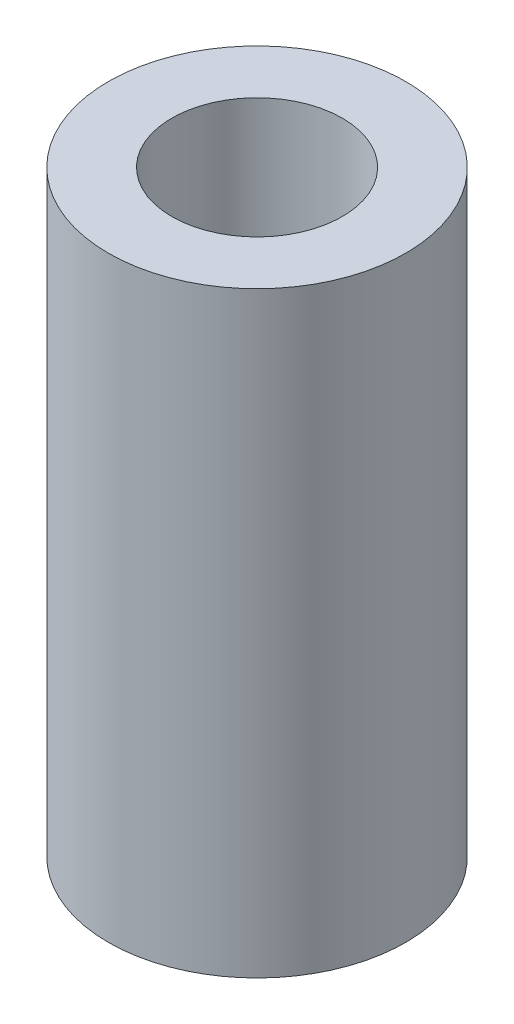
ISO-10303-21;
HEADER;
FILE_DESCRIPTION(('STEP AP214'),'2;1');
FILE_NAME('part.step','',(''),(''),'','','');
FILE_SCHEMA(('AUTOMOTIVE_DESIGN { 1 0 10303 214 1 1 1 1 }'));
ENDSEC;
DATA;
#1=APPLICATION_CONTEXT('core data for automotive mechanical design processes');
#2=APPLICATION_PROTOCOL_DEFINITION('international standard','automotive_design',2000,#1);
#3=PRODUCT_CONTEXT('',#1,'mechanical');
#4=PRODUCT('Part','Part','',(#3));
#5=PRODUCT_RELATED_PRODUCT_CATEGORY('part','',(#4));
#6=PRODUCT_DEFINITION_FORMATION('','',#4);
#7=PRODUCT_DEFINITION_CONTEXT('part definition',#1,'design');
#8=PRODUCT_DEFINITION('design','',#6,#7);
#9=PRODUCT_DEFINITION_SHAPE('','',#8);
#10=(LENGTH_UNIT() NAMED_UNIT(*) SI_UNIT(.MILLI.,.METRE.));
#11=(NAMED_UNIT(*) PLANE_ANGLE_UNIT() SI_UNIT($,.RADIAN.));
#12=(NAMED_UNIT(*) SI_UNIT($,.STERADIAN.) SOLID_ANGLE_UNIT());
#13=UNCERTAINTY_MEASURE_WITH_UNIT(LENGTH_MEASURE(1.E-05),#10,'distance_accuracy_value','');
#14=(GEOMETRIC_REPRESENTATION_CONTEXT(3) GLOBAL_UNCERTAINTY_ASSIGNED_CONTEXT((#13)) GLOBAL_UNIT_ASSIGNED_CONTEXT((#10,
#11,#12)) REPRESENTATION_CONTEXT('',''));
#15=CARTESIAN_POINT('',(0.,0.,0.));
#16=DIRECTION('',(0.,0.,1.));
#17=DIRECTION('',(1.,0.,0.));
#18=AXIS2_PLACEMENT_3D('',#15,#16,#17);
#19=CARTESIAN_POINT('',(0.,14.,0.));
#20=DIRECTION('',(0.,1.,0.));
#21=DIRECTION('',(0.,0.,1.));
#22=AXIS2_PLACEMENT_3D('',#19,#20,#21);
#23=PLANE('',#22);
#24=CARTESIAN_POINT('',(0.,14.,0.));
#25=DIRECTION('',(0.,1.,0.));
#26=DIRECTION('',(0.,0.,1.));
#27=AXIS2_PLACEMENT_3D('',#24,#25,#26);
#28=CIRCLE('',#27,6.975);
#29=CARTESIAN_POINT('',(0.,14.,6.975));
#30=VERTEX_POINT('',#29);
#31=EDGE_CURVE('E10',#30,#30,#28,.T.);
#32=ORIENTED_EDGE('',*,*,#31,.T.);
#33=EDGE_LOOP('',(#32));
#34=FACE_BOUND('',#33,.T.);
#35=CARTESIAN_POINT('',(0.,14.,0.));
#36=DIRECTION('',(0.,1.,0.));
#37=DIRECTION('',(0.,0.,1.));
#38=AXIS2_PLACEMENT_3D('',#35,#36,#37);
#39=CIRCLE('',#38,4.);
#40=CARTESIAN_POINT('',(0.,14.,4.));
#41=VERTEX_POINT('',#40);
#42=EDGE_CURVE('E46',#41,#41,#39,.T.);
#43=ORIENTED_EDGE('',*,*,#42,.F.);
#44=EDGE_LOOP('',(#43));
#45=FACE_BOUND('',#44,.T.);
#46=ADVANCED_FACE('F35',(#34,#45),#23,.T.);
#47=CARTESIAN_POINT('',(0.,-14.,0.));
#48=DIRECTION('',(0.,1.,0.));
#49=DIRECTION('',(0.,0.,1.));
#50=AXIS2_PLACEMENT_3D('',#47,#48,#49);
#51=PLANE('',#50);
#52=CARTESIAN_POINT('',(0.,-14.,0.));
#53=DIRECTION('',(0.,1.,0.));
#54=DIRECTION('',(0.,0.,1.));
#55=AXIS2_PLACEMENT_3D('',#52,#53,#54);
#56=CIRCLE('',#55,6.975);
#57=CARTESIAN_POINT('',(0.,-14.,6.975));
#58=VERTEX_POINT('',#57);
#59=EDGE_CURVE('E39',#58,#58,#56,.T.);
#60=ORIENTED_EDGE('',*,*,#59,.F.);
#61=EDGE_LOOP('',(#60));
#62=FACE_BOUND('',#61,.T.);
#63=CARTESIAN_POINT('',(0.,-14.,0.));
#64=DIRECTION('',(0.,1.,0.));
#65=DIRECTION('',(0.,0.,1.));
#66=AXIS2_PLACEMENT_3D('',#63,#64,#65);
#67=CIRCLE('',#66,4.);
#68=CARTESIAN_POINT('',(0.,-14.,4.));
#69=VERTEX_POINT('',#68);
#70=EDGE_CURVE('E48',#69,#69,#67,.T.);
#71=ORIENTED_EDGE('',*,*,#70,.T.);
#72=EDGE_LOOP('',(#71));
#73=FACE_BOUND('',#72,.T.);
#74=ADVANCED_FACE('F58',(#62,#73),#51,.F.);
#75=CARTESIAN_POINT('',(0.,14.,0.));
#76=DIRECTION('',(0.,-1.,0.));
#77=DIRECTION('',(0.,0.,-1.));
#78=AXIS2_PLACEMENT_3D('',#75,#76,#77);
#79=CYLINDRICAL_SURFACE('',#78,6.975);
#80=ORIENTED_EDGE('',*,*,#31,.F.);
#81=EDGE_LOOP('',(#80));
#82=FACE_BOUND('',#81,.T.);
#83=ORIENTED_EDGE('',*,*,#59,.T.);
#84=EDGE_LOOP('',(#83));
#85=FACE_BOUND('',#84,.T.);
#86=ADVANCED_FACE('F37',(#82,#85),#79,.T.);
#87=CARTESIAN_POINT('',(0.,14.,0.));
#88=DIRECTION('',(0.,-1.,0.));
#89=DIRECTION('',(0.,0.,-1.));
#90=AXIS2_PLACEMENT_3D('',#87,#88,#89);
#91=CYLINDRICAL_SURFACE('',#90,4.);
#92=ORIENTED_EDGE('',*,*,#42,.T.);
#93=EDGE_LOOP('',(#92));
#94=FACE_BOUND('',#93,.T.);
#95=ORIENTED_EDGE('',*,*,#70,.F.);
#96=EDGE_LOOP('',(#95));
#97=FACE_BOUND('',#96,.T.);
#98=ADVANCED_FACE('F54',(#94,#97),#91,.F.);
#99=CLOSED_SHELL('',(#46,#74,#86,#98));
#100=MANIFOLD_SOLID_BREP('B2',#99);
#101=ADVANCED_BREP_SHAPE_REPRESENTATION('',(#18,#100),#14);
#102=SHAPE_DEFINITION_REPRESENTATION(#9,#101);
ENDSEC;
END-ISO-10303-21;
